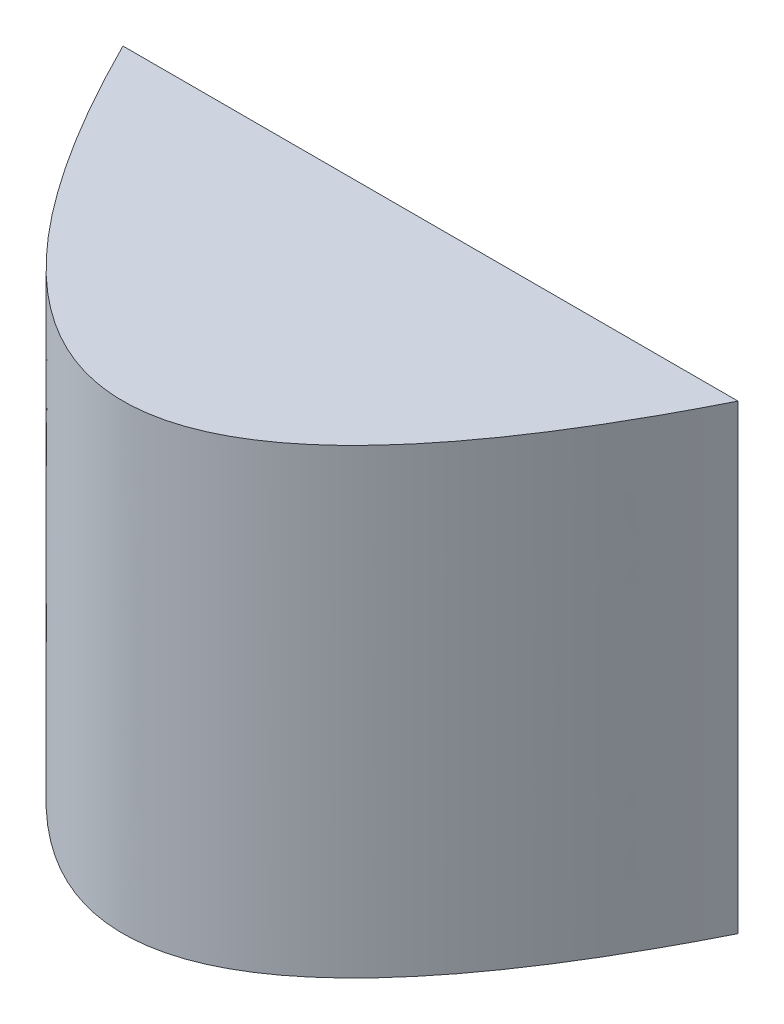
ISO-10303-21;
HEADER;
FILE_DESCRIPTION(('STEP AP214'),'2;1');
FILE_NAME('part.step','',(''),(''),'','','');
FILE_SCHEMA(('AUTOMOTIVE_DESIGN { 1 0 10303 214 1 1 1 1 }'));
ENDSEC;
DATA;
#1=APPLICATION_CONTEXT('core data for automotive mechanical design processes');
#2=APPLICATION_PROTOCOL_DEFINITION('international standard','automotive_design',2000,#1);
#3=PRODUCT_CONTEXT('',#1,'mechanical');
#4=PRODUCT('Part','Part','',(#3));
#5=PRODUCT_RELATED_PRODUCT_CATEGORY('part','',(#4));
#6=PRODUCT_DEFINITION_FORMATION('','',#4);
#7=PRODUCT_DEFINITION_CONTEXT('part definition',#1,'design');
#8=PRODUCT_DEFINITION('design','',#6,#7);
#9=PRODUCT_DEFINITION_SHAPE('','',#8);
#10=(LENGTH_UNIT() NAMED_UNIT(*) SI_UNIT(.MILLI.,.METRE.));
#11=(NAMED_UNIT(*) PLANE_ANGLE_UNIT() SI_UNIT($,.RADIAN.));
#12=(NAMED_UNIT(*) SI_UNIT($,.STERADIAN.) SOLID_ANGLE_UNIT());
#13=UNCERTAINTY_MEASURE_WITH_UNIT(LENGTH_MEASURE(1.E-05),#10,'distance_accuracy_value','');
#14=(GEOMETRIC_REPRESENTATION_CONTEXT(3) GLOBAL_UNCERTAINTY_ASSIGNED_CONTEXT((#13)) GLOBAL_UNIT_ASSIGNED_CONTEXT((#10,
#11,#12)) REPRESENTATION_CONTEXT('',''));
#15=CARTESIAN_POINT('',(0.,0.,0.));
#16=DIRECTION('',(0.,0.,1.));
#17=DIRECTION('',(1.,0.,0.));
#18=AXIS2_PLACEMENT_3D('',#15,#16,#17);
#19=CARTESIAN_POINT('',(-200.000000000337,300.,-6.70196537155832E-10));
#20=CARTESIAN_POINT('',(-5.91540705308091E-11,300.,400.000000000552));
#21=CARTESIAN_POINT('',(200.000000000219,300.,-4.34305369445553E-10));
#22=B_SPLINE_CURVE_WITH_KNOTS('',2,(#19,#20,#21),.UNSPECIFIED.,.F.,.F.,(3,3),(0.056028396232078,
0.943971603767659),.UNSPECIFIED.);
#23=DIRECTION('',(0.,-1.,0.));
#24=VECTOR('',#23,1.);
#25=SURFACE_OF_LINEAR_EXTRUSION('',#22,#24);
#26=CARTESIAN_POINT('',(-200.000000000337,0.,-6.70196537155832E-10));
#27=CARTESIAN_POINT('',(-5.91540705308091E-11,0.,400.000000000552));
#28=CARTESIAN_POINT('',(200.000000000219,0.,-4.34305369445553E-10));
#29=B_SPLINE_CURVE_WITH_KNOTS('',2,(#26,#27,#28),.UNSPECIFIED.,.F.,.F.,(3,3),(0.056028396232078,
0.943971603767659),.UNSPECIFIED.);
#30=CARTESIAN_POINT('',(-200.00000000027,0.,-5.35238059385865E-10));
#31=VERTEX_POINT('',#30);
#32=CARTESIAN_POINT('',(200.000000000156,0.,-5.35238059385865E-10));
#33=VERTEX_POINT('',#32);
#34=EDGE_CURVE('E64',#31,#33,#29,.T.);
#35=ORIENTED_EDGE('',*,*,#34,.T.);
#36=DIRECTION('',(0.,-1.,0.));
#37=VECTOR('',#36,1.);
#38=CARTESIAN_POINT('',(200.000000000156,300.,-5.35238059385865E-10));
#39=LINE('',#38,#37);
#40=CARTESIAN_POINT('',(200.000000000156,300.,-5.35238059385865E-10));
#41=VERTEX_POINT('',#40);
#42=EDGE_CURVE('E11',#41,#33,#39,.T.);
#43=ORIENTED_EDGE('',*,*,#42,.F.);
#44=CARTESIAN_POINT('',(-200.00000000027,300.,-5.35238059385865E-10));
#45=VERTEX_POINT('',#44);
#46=EDGE_CURVE('E63',#45,#41,#22,.T.);
#47=ORIENTED_EDGE('',*,*,#46,.F.);
#48=DIRECTION('',(0.,-1.,0.));
#49=VECTOR('',#48,1.);
#50=CARTESIAN_POINT('',(-200.00000000027,300.,-5.35238059385865E-10));
#51=LINE('',#50,#49);
#52=EDGE_CURVE('E41',#45,#31,#51,.T.);
#53=ORIENTED_EDGE('',*,*,#52,.T.);
#54=EDGE_LOOP('',(#35,#43,#47,#53));
#55=FACE_BOUND('',#54,.T.);
#56=ADVANCED_FACE('F32',(#55),#25,.F.);
#57=CARTESIAN_POINT('',(-200.00000000027,300.,-5.35238059385865E-10));
#58=DIRECTION('',(0.,0.,1.));
#59=DIRECTION('',(1.,0.,0.));
#60=AXIS2_PLACEMENT_3D('',#57,#58,#59);
#61=PLANE('',#60);
#62=DIRECTION('',(-1.,0.,0.));
#63=VECTOR('',#62,1.);
#64=CARTESIAN_POINT('',(-200.00000000027,0.,-5.35238059385865E-10));
#65=LINE('',#64,#63);
#66=EDGE_CURVE('E56',#33,#31,#65,.T.);
#67=ORIENTED_EDGE('',*,*,#66,.T.);
#68=ORIENTED_EDGE('',*,*,#52,.F.);
#69=DIRECTION('',(-1.,0.,0.));
#70=VECTOR('',#69,1.);
#71=CARTESIAN_POINT('',(-200.00000000027,300.,-5.35238059385865E-10));
#72=LINE('',#71,#70);
#73=EDGE_CURVE('E48',#41,#45,#72,.T.);
#74=ORIENTED_EDGE('',*,*,#73,.F.);
#75=ORIENTED_EDGE('',*,*,#42,.T.);
#76=EDGE_LOOP('',(#67,#68,#74,#75));
#77=FACE_BOUND('',#76,.T.);
#78=ADVANCED_FACE('F59',(#77),#61,.F.);
#79=CARTESIAN_POINT('',(-5.9161009424713E-11,300.,200.));
#80=DIRECTION('',(0.,-1.,0.));
#81=DIRECTION('',(0.,0.,-1.));
#82=AXIS2_PLACEMENT_3D('',#79,#80,#81);
#83=PLANE('',#82);
#84=ORIENTED_EDGE('',*,*,#46,.T.);
#85=ORIENTED_EDGE('',*,*,#73,.T.);
#86=EDGE_LOOP('',(#84,#85));
#87=FACE_BOUND('',#86,.T.);
#88=ADVANCED_FACE('F81',(#87),#83,.F.);
#89=CARTESIAN_POINT('',(-5.9161009424713E-11,0.,200.));
#90=DIRECTION('',(0.,-1.,0.));
#91=DIRECTION('',(0.,0.,-1.));
#92=AXIS2_PLACEMENT_3D('',#89,#90,#91);
#93=PLANE('',#92);
#94=ORIENTED_EDGE('',*,*,#34,.F.);
#95=ORIENTED_EDGE('',*,*,#66,.F.);
#96=EDGE_LOOP('',(#94,#95));
#97=FACE_BOUND('',#96,.T.);
#98=ADVANCED_FACE('F67',(#97),#93,.T.);
#99=CLOSED_SHELL('',(#56,#78,#88,#98));
#100=MANIFOLD_SOLID_BREP('B2',#99);
#101=ADVANCED_BREP_SHAPE_REPRESENTATION('',(#18,#100),#14);
#102=SHAPE_DEFINITION_REPRESENTATION(#9,#101);
ENDSEC;
END-ISO-10303-21;
